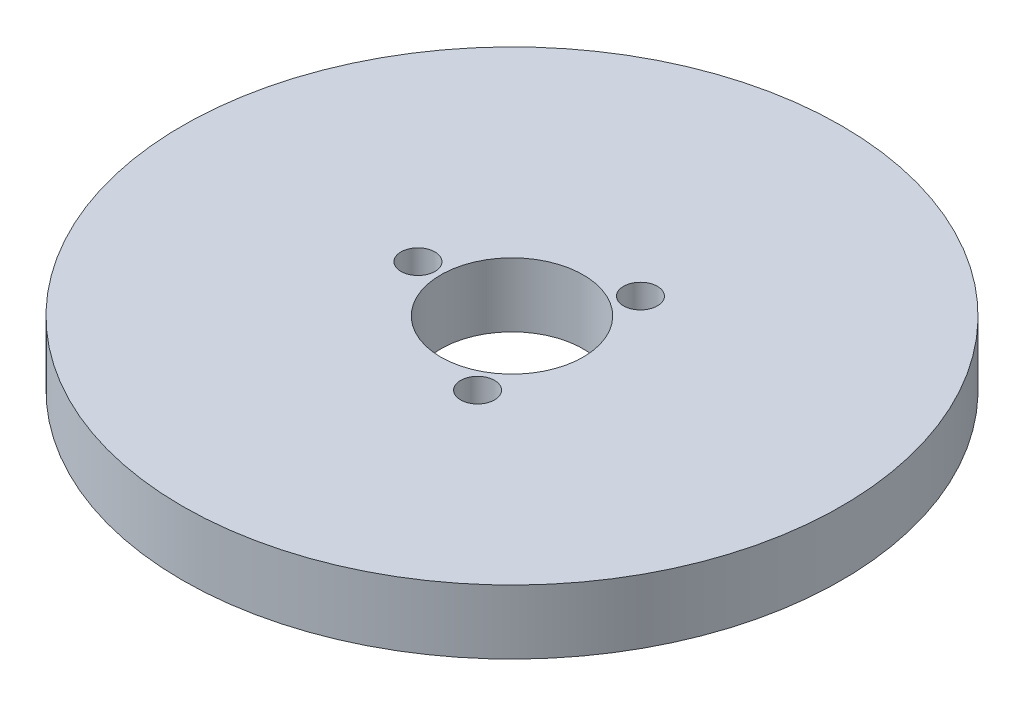
ISO-10303-21;
HEADER;
FILE_DESCRIPTION(('STEP AP214'),'2;1');
FILE_NAME('part.step','',(''),(''),'','','');
FILE_SCHEMA(('AUTOMOTIVE_DESIGN { 1 0 10303 214 1 1 1 1 }'));
ENDSEC;
DATA;
#1=APPLICATION_CONTEXT('core data for automotive mechanical design processes');
#2=APPLICATION_PROTOCOL_DEFINITION('international standard','automotive_design',2000,#1);
#3=PRODUCT_CONTEXT('',#1,'mechanical');
#4=PRODUCT('Part','Part','',(#3));
#5=PRODUCT_RELATED_PRODUCT_CATEGORY('part','',(#4));
#6=PRODUCT_DEFINITION_FORMATION('','',#4);
#7=PRODUCT_DEFINITION_CONTEXT('part definition',#1,'design');
#8=PRODUCT_DEFINITION('design','',#6,#7);
#9=PRODUCT_DEFINITION_SHAPE('','',#8);
#10=(LENGTH_UNIT() NAMED_UNIT(*) SI_UNIT(.MILLI.,.METRE.));
#11=(NAMED_UNIT(*) PLANE_ANGLE_UNIT() SI_UNIT($,.RADIAN.));
#12=(NAMED_UNIT(*) SI_UNIT($,.STERADIAN.) SOLID_ANGLE_UNIT());
#13=UNCERTAINTY_MEASURE_WITH_UNIT(LENGTH_MEASURE(1.E-05),#10,'distance_accuracy_value','');
#14=(GEOMETRIC_REPRESENTATION_CONTEXT(3) GLOBAL_UNCERTAINTY_ASSIGNED_CONTEXT((#13)) GLOBAL_UNIT_ASSIGNED_CONTEXT((#10,
#11,#12)) REPRESENTATION_CONTEXT('',''));
#15=CARTESIAN_POINT('',(0.,0.,0.));
#16=DIRECTION('',(0.,0.,1.));
#17=DIRECTION('',(1.,0.,0.));
#18=AXIS2_PLACEMENT_3D('',#15,#16,#17);
#19=CARTESIAN_POINT('',(0.,18.,0.));
#20=DIRECTION('',(0.,-1.,0.));
#21=DIRECTION('',(0.,0.,-1.));
#22=AXIS2_PLACEMENT_3D('',#19,#20,#21);
#23=CYLINDRICAL_SURFACE('',#22,92.5);
#24=CARTESIAN_POINT('',(0.,18.,0.));
#25=DIRECTION('',(0.,1.,0.));
#26=DIRECTION('',(0.,0.,1.));
#27=AXIS2_PLACEMENT_3D('',#24,#25,#26);
#28=CIRCLE('',#27,92.5);
#29=CARTESIAN_POINT('',(0.,18.,92.5));
#30=VERTEX_POINT('',#29);
#31=EDGE_CURVE('E10',#30,#30,#28,.T.);
#32=ORIENTED_EDGE('',*,*,#31,.F.);
#33=EDGE_LOOP('',(#32));
#34=FACE_BOUND('',#33,.T.);
#35=CARTESIAN_POINT('',(0.,0.,0.));
#36=DIRECTION('',(0.,1.,0.));
#37=DIRECTION('',(0.,0.,1.));
#38=AXIS2_PLACEMENT_3D('',#35,#36,#37);
#39=CIRCLE('',#38,92.5);
#40=CARTESIAN_POINT('',(0.,0.,92.5));
#41=VERTEX_POINT('',#40);
#42=EDGE_CURVE('E37',#41,#41,#39,.T.);
#43=ORIENTED_EDGE('',*,*,#42,.T.);
#44=EDGE_LOOP('',(#43));
#45=FACE_BOUND('',#44,.T.);
#46=ADVANCED_FACE('F40',(#34,#45),#23,.T.);
#47=CARTESIAN_POINT('',(0.,18.,0.));
#48=DIRECTION('',(0.,1.,0.));
#49=DIRECTION('',(0.,0.,1.));
#50=AXIS2_PLACEMENT_3D('',#47,#48,#49);
#51=PLANE('',#50);
#52=CARTESIAN_POINT('',(13.1988924638119,18.,22.86115235096));
#53=DIRECTION('',(0.,1.,0.));
#54=DIRECTION('',(0.866025403784436,0.,-0.500000000000004));
#55=AXIS2_PLACEMENT_3D('',#52,#53,#54);
#56=CIRCLE('',#55,4.76306249820334);
#57=CARTESIAN_POINT('',(17.323825587069,18.,20.4796211018583));
#58=VERTEX_POINT('',#57);
#59=EDGE_CURVE('E70',#58,#58,#56,.T.);
#60=ORIENTED_EDGE('',*,*,#59,.F.);
#61=EDGE_LOOP('',(#60));
#62=FACE_BOUND('',#61,.T.);
#63=CARTESIAN_POINT('',(13.1988924638116,18.,-22.8611523509602));
#64=DIRECTION('',(0.,1.,0.));
#65=DIRECTION('',(-0.866025403784443,0.,-0.499999999999992));
#66=AXIS2_PLACEMENT_3D('',#63,#64,#65);
#67=CIRCLE('',#66,4.76306249820334);
#68=CARTESIAN_POINT('',(9.07395934055452,18.,-25.2426836000618));
#69=VERTEX_POINT('',#68);
#70=EDGE_CURVE('E61',#69,#69,#67,.T.);
#71=ORIENTED_EDGE('',*,*,#70,.F.);
#72=EDGE_LOOP('',(#71));
#73=FACE_BOUND('',#72,.T.);
#74=CARTESIAN_POINT('',(-26.3977849276236,18.,0.));
#75=DIRECTION('',(0.,1.,0.));
#76=DIRECTION('',(0.,0.,1.));
#77=AXIS2_PLACEMENT_3D('',#74,#75,#76);
#78=CIRCLE('',#77,4.76306249820334);
#79=CARTESIAN_POINT('',(-26.3977849276236,18.,4.76306249820334));
#80=VERTEX_POINT('',#79);
#81=EDGE_CURVE('E54',#80,#80,#78,.T.);
#82=ORIENTED_EDGE('',*,*,#81,.F.);
#83=EDGE_LOOP('',(#82));
#84=FACE_BOUND('',#83,.T.);
#85=CARTESIAN_POINT('',(0.,18.,0.));
#86=DIRECTION('',(0.,1.,0.));
#87=DIRECTION('',(0.,0.,1.));
#88=AXIS2_PLACEMENT_3D('',#85,#86,#87);
#89=CIRCLE('',#88,20.);
#90=CARTESIAN_POINT('',(0.,18.,20.));
#91=VERTEX_POINT('',#90);
#92=EDGE_CURVE('E50',#91,#91,#89,.T.);
#93=ORIENTED_EDGE('',*,*,#92,.F.);
#94=EDGE_LOOP('',(#93));
#95=FACE_BOUND('',#94,.T.);
#96=ORIENTED_EDGE('',*,*,#31,.T.);
#97=EDGE_LOOP('',(#96));
#98=FACE_BOUND('',#97,.T.);
#99=ADVANCED_FACE('F85',(#62,#73,#84,#95,#98),#51,.T.);
#100=CARTESIAN_POINT('',(0.,0.,0.));
#101=DIRECTION('',(0.,1.,0.));
#102=DIRECTION('',(0.,0.,1.));
#103=AXIS2_PLACEMENT_3D('',#100,#101,#102);
#104=PLANE('',#103);
#105=CARTESIAN_POINT('',(0.,0.,0.));
#106=DIRECTION('',(0.,1.,0.));
#107=DIRECTION('',(0.,0.,1.));
#108=AXIS2_PLACEMENT_3D('',#105,#106,#107);
#109=CIRCLE('',#108,20.);
#110=CARTESIAN_POINT('',(0.,0.,20.));
#111=VERTEX_POINT('',#110);
#112=EDGE_CURVE('E47',#111,#111,#109,.T.);
#113=ORIENTED_EDGE('',*,*,#112,.T.);
#114=EDGE_LOOP('',(#113));
#115=FACE_BOUND('',#114,.T.);
#116=ORIENTED_EDGE('',*,*,#42,.F.);
#117=EDGE_LOOP('',(#116));
#118=FACE_BOUND('',#117,.T.);
#119=ADVANCED_FACE('F84',(#115,#118),#104,.F.);
#120=CARTESIAN_POINT('',(0.,18.,0.));
#121=DIRECTION('',(0.,-1.,0.));
#122=DIRECTION('',(0.,0.,-1.));
#123=AXIS2_PLACEMENT_3D('',#120,#121,#122);
#124=CYLINDRICAL_SURFACE('',#123,20.);
#125=ORIENTED_EDGE('',*,*,#92,.T.);
#126=EDGE_LOOP('',(#125));
#127=FACE_BOUND('',#126,.T.);
#128=ORIENTED_EDGE('',*,*,#112,.F.);
#129=EDGE_LOOP('',(#128));
#130=FACE_BOUND('',#129,.T.);
#131=ADVANCED_FACE('F91',(#127,#130),#124,.F.);
#132=CARTESIAN_POINT('',(-26.3977849276236,0.241728195492296,0.));
#133=DIRECTION('',(0.,1.,0.));
#134=DIRECTION('',(0.,0.,1.));
#135=AXIS2_PLACEMENT_3D('',#132,#133,#134);
#136=CYLINDRICAL_SURFACE('',#135,4.76306249820334);
#137=CARTESIAN_POINT('',(-26.3977849276236,0.241728195492296,0.));
#138=DIRECTION('',(0.,1.,0.));
#139=DIRECTION('',(0.,0.,1.));
#140=AXIS2_PLACEMENT_3D('',#137,#138,#139);
#141=CIRCLE('',#140,4.76306249820334);
#142=CARTESIAN_POINT('',(-26.3977849276236,0.241728195492296,4.76306249820334));
#143=VERTEX_POINT('',#142);
#144=EDGE_CURVE('E55',#143,#143,#141,.T.);
#145=ORIENTED_EDGE('',*,*,#144,.F.);
#146=EDGE_LOOP('',(#145));
#147=FACE_BOUND('',#146,.T.);
#148=ORIENTED_EDGE('',*,*,#81,.T.);
#149=EDGE_LOOP('',(#148));
#150=FACE_BOUND('',#149,.T.);
#151=ADVANCED_FACE('F96',(#147,#150),#136,.F.);
#152=CARTESIAN_POINT('',(-26.3977849276236,0.241728195492296,0.));
#153=DIRECTION('',(0.,1.,0.));
#154=DIRECTION('',(0.,0.,1.));
#155=AXIS2_PLACEMENT_3D('',#152,#153,#154);
#156=PLANE('',#155);
#157=ORIENTED_EDGE('',*,*,#144,.T.);
#158=EDGE_LOOP('',(#157));
#159=FACE_BOUND('',#158,.T.);
#160=ADVANCED_FACE('F127',(#159),#156,.T.);
#161=CARTESIAN_POINT('',(13.1988924638116,0.241728195492296,-22.8611523509602));
#162=DIRECTION('',(0.,1.,0.));
#163=DIRECTION('',(0.,0.,1.));
#164=AXIS2_PLACEMENT_3D('',#161,#162,#163);
#165=CYLINDRICAL_SURFACE('',#164,4.76306249820334);
#166=CARTESIAN_POINT('',(13.1988924638116,0.241728195492296,-22.8611523509602));
#167=DIRECTION('',(0.,1.,0.));
#168=DIRECTION('',(-0.866025403784443,0.,-0.499999999999992));
#169=AXIS2_PLACEMENT_3D('',#166,#167,#168);
#170=CIRCLE('',#169,4.76306249820334);
#171=CARTESIAN_POINT('',(9.07395934055452,0.241728195492296,-25.2426836000618));
#172=VERTEX_POINT('',#171);
#173=EDGE_CURVE('E63',#172,#172,#170,.T.);
#174=ORIENTED_EDGE('',*,*,#173,.F.);
#175=EDGE_LOOP('',(#174));
#176=FACE_BOUND('',#175,.T.);
#177=ORIENTED_EDGE('',*,*,#70,.T.);
#178=EDGE_LOOP('',(#177));
#179=FACE_BOUND('',#178,.T.);
#180=ADVANCED_FACE('F133',(#176,#179),#165,.F.);
#181=CARTESIAN_POINT('',(13.1988924638116,0.241728195492296,-22.8611523509602));
#182=DIRECTION('',(0.,1.,0.));
#183=DIRECTION('',(-0.866025403784443,0.,-0.499999999999992));
#184=AXIS2_PLACEMENT_3D('',#181,#182,#183);
#185=PLANE('',#184);
#186=ORIENTED_EDGE('',*,*,#173,.T.);
#187=EDGE_LOOP('',(#186));
#188=FACE_BOUND('',#187,.T.);
#189=ADVANCED_FACE('F77',(#188),#185,.T.);
#190=CARTESIAN_POINT('',(13.1988924638119,0.241728195492296,22.86115235096));
#191=DIRECTION('',(0.,1.,0.));
#192=DIRECTION('',(0.,0.,1.));
#193=AXIS2_PLACEMENT_3D('',#190,#191,#192);
#194=CYLINDRICAL_SURFACE('',#193,4.76306249820334);
#195=CARTESIAN_POINT('',(13.1988924638119,0.241728195492296,22.86115235096));
#196=DIRECTION('',(0.,1.,0.));
#197=DIRECTION('',(0.866025403784436,0.,-0.500000000000004));
#198=AXIS2_PLACEMENT_3D('',#195,#196,#197);
#199=CIRCLE('',#198,4.76306249820334);
#200=CARTESIAN_POINT('',(17.323825587069,0.241728195492296,20.4796211018583));
#201=VERTEX_POINT('',#200);
#202=EDGE_CURVE('E59',#201,#201,#199,.T.);
#203=ORIENTED_EDGE('',*,*,#202,.F.);
#204=EDGE_LOOP('',(#203));
#205=FACE_BOUND('',#204,.T.);
#206=ORIENTED_EDGE('',*,*,#59,.T.);
#207=EDGE_LOOP('',(#206));
#208=FACE_BOUND('',#207,.T.);
#209=ADVANCED_FACE('F73',(#205,#208),#194,.F.);
#210=CARTESIAN_POINT('',(13.1988924638119,0.241728195492296,22.86115235096));
#211=DIRECTION('',(0.,1.,0.));
#212=DIRECTION('',(0.866025403784436,0.,-0.500000000000004));
#213=AXIS2_PLACEMENT_3D('',#210,#211,#212);
#214=PLANE('',#213);
#215=ORIENTED_EDGE('',*,*,#202,.T.);
#216=EDGE_LOOP('',(#215));
#217=FACE_BOUND('',#216,.T.);
#218=ADVANCED_FACE('F71',(#217),#214,.T.);
#219=CLOSED_SHELL('',(#46,#99,#119,#131,#151,#160,#180,#189,#209,#218));
#220=MANIFOLD_SOLID_BREP('B2',#219);
#221=ADVANCED_BREP_SHAPE_REPRESENTATION('',(#18,#220),#14);
#222=SHAPE_DEFINITION_REPRESENTATION(#9,#221);
ENDSEC;
END-ISO-10303-21;
